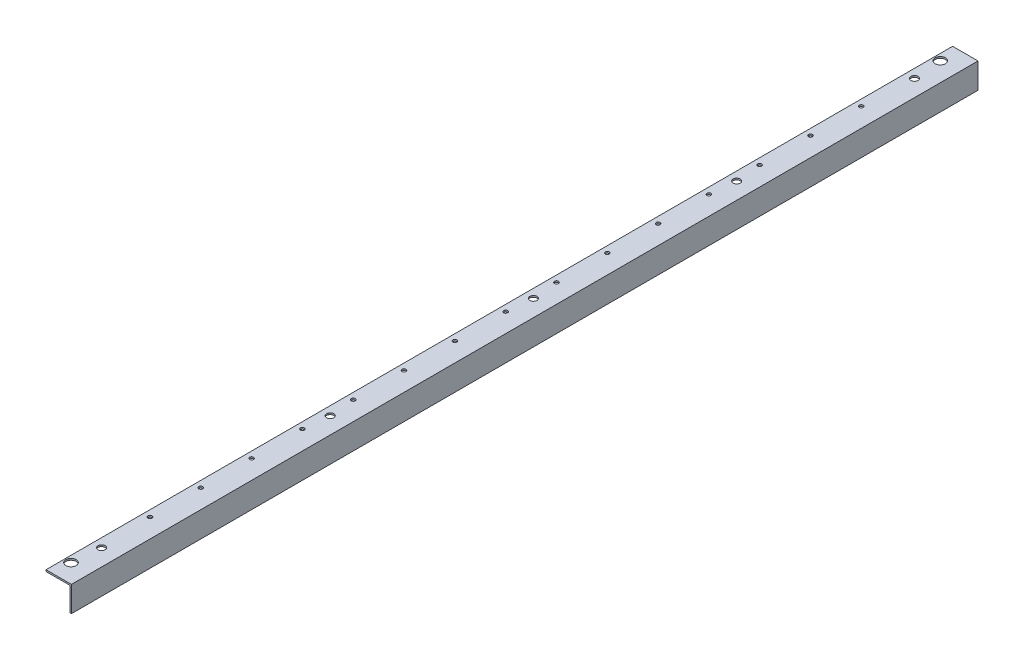
ISO-10303-21;
HEADER;
FILE_DESCRIPTION(('STEP AP214'),'2;1');
FILE_NAME('part.step','',(''),(''),'','','');
FILE_SCHEMA(('AUTOMOTIVE_DESIGN { 1 0 10303 214 1 1 1 1 }'));
ENDSEC;
DATA;
#1=APPLICATION_CONTEXT('core data for automotive mechanical design processes');
#2=APPLICATION_PROTOCOL_DEFINITION('international standard','automotive_design',2000,#1);
#3=PRODUCT_CONTEXT('',#1,'mechanical');
#4=PRODUCT('Part','Part','',(#3));
#5=PRODUCT_RELATED_PRODUCT_CATEGORY('part','',(#4));
#6=PRODUCT_DEFINITION_FORMATION('','',#4);
#7=PRODUCT_DEFINITION_CONTEXT('part definition',#1,'design');
#8=PRODUCT_DEFINITION('design','',#6,#7);
#9=PRODUCT_DEFINITION_SHAPE('','',#8);
#10=(LENGTH_UNIT() NAMED_UNIT(*) SI_UNIT(.MILLI.,.METRE.));
#11=(NAMED_UNIT(*) PLANE_ANGLE_UNIT() SI_UNIT($,.RADIAN.));
#12=(NAMED_UNIT(*) SI_UNIT($,.STERADIAN.) SOLID_ANGLE_UNIT());
#13=UNCERTAINTY_MEASURE_WITH_UNIT(LENGTH_MEASURE(1.E-05),#10,'distance_accuracy_value','');
#14=(GEOMETRIC_REPRESENTATION_CONTEXT(3) GLOBAL_UNCERTAINTY_ASSIGNED_CONTEXT((#13)) GLOBAL_UNIT_ASSIGNED_CONTEXT((#10,
#11,#12)) REPRESENTATION_CONTEXT('',''));
#15=CARTESIAN_POINT('',(0.,0.,0.));
#16=DIRECTION('',(0.,0.,1.));
#17=DIRECTION('',(1.,0.,0.));
#18=AXIS2_PLACEMENT_3D('',#15,#16,#17);
#19=CARTESIAN_POINT('',(-38.1,-44.45,1617.6625));
#20=DIRECTION('',(0.,1.,0.));
#21=DIRECTION('',(0.,0.,1.));
#22=AXIS2_PLACEMENT_3D('',#19,#20,#21);
#23=CYLINDRICAL_SURFACE('',#22,3.96874999999999);
#24=CARTESIAN_POINT('',(-38.1,0.,1617.6625));
#25=DIRECTION('',(0.,1.,0.));
#26=DIRECTION('',(0.,0.,1.));
#27=AXIS2_PLACEMENT_3D('',#24,#25,#26);
#28=CIRCLE('',#27,3.96874999999999);
#29=CARTESIAN_POINT('',(-38.1,0.,1621.63125));
#30=VERTEX_POINT('',#29);
#31=EDGE_CURVE('E44',#30,#30,#28,.T.);
#32=ORIENTED_EDGE('',*,*,#31,.T.);
#33=EDGE_LOOP('',(#32));
#34=FACE_BOUND('',#33,.T.);
#35=CARTESIAN_POINT('',(-38.1,-3.175,1617.6625));
#36=DIRECTION('',(0.,1.,0.));
#37=DIRECTION('',(0.,0.,1.));
#38=AXIS2_PLACEMENT_3D('',#35,#36,#37);
#39=CIRCLE('',#38,3.96874999999999);
#40=CARTESIAN_POINT('',(-38.1,-3.175,1621.63125));
#41=VERTEX_POINT('',#40);
#42=EDGE_CURVE('E11',#41,#41,#39,.T.);
#43=ORIENTED_EDGE('',*,*,#42,.F.);
#44=EDGE_LOOP('',(#43));
#45=FACE_BOUND('',#44,.T.);
#46=ADVANCED_FACE('F36',(#34,#45),#23,.F.);
#47=CARTESIAN_POINT('',(-38.1,-44.45,1516.0625));
#48=DIRECTION('',(0.,1.,0.));
#49=DIRECTION('',(0.,0.,1.));
#50=AXIS2_PLACEMENT_3D('',#47,#48,#49);
#51=CYLINDRICAL_SURFACE('',#50,3.96874999999999);
#52=CARTESIAN_POINT('',(-38.1,0.,1516.0625));
#53=DIRECTION('',(0.,1.,0.));
#54=DIRECTION('',(0.,0.,1.));
#55=AXIS2_PLACEMENT_3D('',#52,#53,#54);
#56=CIRCLE('',#55,3.96874999999999);
#57=CARTESIAN_POINT('',(-38.1,0.,1520.03125));
#58=VERTEX_POINT('',#57);
#59=EDGE_CURVE('E234',#58,#58,#56,.T.);
#60=ORIENTED_EDGE('',*,*,#59,.T.);
#61=EDGE_LOOP('',(#60));
#62=FACE_BOUND('',#61,.T.);
#63=CARTESIAN_POINT('',(-38.1,-3.175,1516.0625));
#64=DIRECTION('',(0.,1.,0.));
#65=DIRECTION('',(0.,0.,1.));
#66=AXIS2_PLACEMENT_3D('',#63,#64,#65);
#67=CIRCLE('',#66,3.96874999999999);
#68=CARTESIAN_POINT('',(-38.1,-3.175,1520.03125));
#69=VERTEX_POINT('',#68);
#70=EDGE_CURVE('E237',#69,#69,#67,.T.);
#71=ORIENTED_EDGE('',*,*,#70,.F.);
#72=EDGE_LOOP('',(#71));
#73=FACE_BOUND('',#72,.T.);
#74=ADVANCED_FACE('F262',(#62,#73),#51,.F.);
#75=CARTESIAN_POINT('',(-38.1,-44.45,1414.4625));
#76=DIRECTION('',(0.,1.,0.));
#77=DIRECTION('',(0.,0.,1.));
#78=AXIS2_PLACEMENT_3D('',#75,#76,#77);
#79=CYLINDRICAL_SURFACE('',#78,3.96874999999999);
#80=CARTESIAN_POINT('',(-38.1,0.,1414.4625));
#81=DIRECTION('',(0.,1.,0.));
#82=DIRECTION('',(0.,0.,1.));
#83=AXIS2_PLACEMENT_3D('',#80,#81,#82);
#84=CIRCLE('',#83,3.96874999999999);
#85=CARTESIAN_POINT('',(-38.1,0.,1418.43125));
#86=VERTEX_POINT('',#85);
#87=EDGE_CURVE('E228',#86,#86,#84,.T.);
#88=ORIENTED_EDGE('',*,*,#87,.T.);
#89=EDGE_LOOP('',(#88));
#90=FACE_BOUND('',#89,.T.);
#91=CARTESIAN_POINT('',(-38.1,-3.175,1414.4625));
#92=DIRECTION('',(0.,1.,0.));
#93=DIRECTION('',(0.,0.,1.));
#94=AXIS2_PLACEMENT_3D('',#91,#92,#93);
#95=CIRCLE('',#94,3.96874999999999);
#96=CARTESIAN_POINT('',(-38.1,-3.175,1418.43125));
#97=VERTEX_POINT('',#96);
#98=EDGE_CURVE('E231',#97,#97,#95,.T.);
#99=ORIENTED_EDGE('',*,*,#98,.F.);
#100=EDGE_LOOP('',(#99));
#101=FACE_BOUND('',#100,.T.);
#102=ADVANCED_FACE('F266',(#90,#101),#79,.F.);
#103=CARTESIAN_POINT('',(-38.1,-44.45,1312.8625));
#104=DIRECTION('',(0.,1.,0.));
#105=DIRECTION('',(0.,0.,1.));
#106=AXIS2_PLACEMENT_3D('',#103,#104,#105);
#107=CYLINDRICAL_SURFACE('',#106,3.96874999999999);
#108=CARTESIAN_POINT('',(-38.1,0.,1312.8625));
#109=DIRECTION('',(0.,1.,0.));
#110=DIRECTION('',(0.,0.,1.));
#111=AXIS2_PLACEMENT_3D('',#108,#109,#110);
#112=CIRCLE('',#111,3.96874999999999);
#113=CARTESIAN_POINT('',(-38.1,0.,1316.83125));
#114=VERTEX_POINT('',#113);
#115=EDGE_CURVE('E222',#114,#114,#112,.T.);
#116=ORIENTED_EDGE('',*,*,#115,.T.);
#117=EDGE_LOOP('',(#116));
#118=FACE_BOUND('',#117,.T.);
#119=CARTESIAN_POINT('',(-38.1,-3.175,1312.8625));
#120=DIRECTION('',(0.,1.,0.));
#121=DIRECTION('',(0.,0.,1.));
#122=AXIS2_PLACEMENT_3D('',#119,#120,#121);
#123=CIRCLE('',#122,3.96874999999999);
#124=CARTESIAN_POINT('',(-38.1,-3.175,1316.83125));
#125=VERTEX_POINT('',#124);
#126=EDGE_CURVE('E225',#125,#125,#123,.T.);
#127=ORIENTED_EDGE('',*,*,#126,.F.);
#128=EDGE_LOOP('',(#127));
#129=FACE_BOUND('',#128,.T.);
#130=ADVANCED_FACE('F271',(#118,#129),#107,.F.);
#131=CARTESIAN_POINT('',(-38.1,-44.45,1211.2625));
#132=DIRECTION('',(0.,1.,0.));
#133=DIRECTION('',(0.,0.,1.));
#134=AXIS2_PLACEMENT_3D('',#131,#132,#133);
#135=CYLINDRICAL_SURFACE('',#134,3.96874999999999);
#136=CARTESIAN_POINT('',(-38.1,0.,1211.2625));
#137=DIRECTION('',(0.,1.,0.));
#138=DIRECTION('',(0.,0.,1.));
#139=AXIS2_PLACEMENT_3D('',#136,#137,#138);
#140=CIRCLE('',#139,3.96874999999999);
#141=CARTESIAN_POINT('',(-38.1,0.,1215.23125));
#142=VERTEX_POINT('',#141);
#143=EDGE_CURVE('E216',#142,#142,#140,.T.);
#144=ORIENTED_EDGE('',*,*,#143,.T.);
#145=EDGE_LOOP('',(#144));
#146=FACE_BOUND('',#145,.T.);
#147=CARTESIAN_POINT('',(-38.1,-3.175,1211.2625));
#148=DIRECTION('',(0.,1.,0.));
#149=DIRECTION('',(0.,0.,1.));
#150=AXIS2_PLACEMENT_3D('',#147,#148,#149);
#151=CIRCLE('',#150,3.96874999999999);
#152=CARTESIAN_POINT('',(-38.1,-3.175,1215.23125));
#153=VERTEX_POINT('',#152);
#154=EDGE_CURVE('E219',#153,#153,#151,.T.);
#155=ORIENTED_EDGE('',*,*,#154,.F.);
#156=EDGE_LOOP('',(#155));
#157=FACE_BOUND('',#156,.T.);
#158=ADVANCED_FACE('F278',(#146,#157),#135,.F.);
#159=CARTESIAN_POINT('',(-38.1,-44.45,1109.6625));
#160=DIRECTION('',(0.,1.,0.));
#161=DIRECTION('',(0.,0.,1.));
#162=AXIS2_PLACEMENT_3D('',#159,#160,#161);
#163=CYLINDRICAL_SURFACE('',#162,3.96874999999999);
#164=CARTESIAN_POINT('',(-38.1,0.,1109.6625));
#165=DIRECTION('',(0.,1.,0.));
#166=DIRECTION('',(0.,0.,1.));
#167=AXIS2_PLACEMENT_3D('',#164,#165,#166);
#168=CIRCLE('',#167,3.96874999999999);
#169=CARTESIAN_POINT('',(-38.1,0.,1113.63125));
#170=VERTEX_POINT('',#169);
#171=EDGE_CURVE('E210',#170,#170,#168,.T.);
#172=ORIENTED_EDGE('',*,*,#171,.T.);
#173=EDGE_LOOP('',(#172));
#174=FACE_BOUND('',#173,.T.);
#175=CARTESIAN_POINT('',(-38.1,-3.175,1109.6625));
#176=DIRECTION('',(0.,1.,0.));
#177=DIRECTION('',(0.,0.,1.));
#178=AXIS2_PLACEMENT_3D('',#175,#176,#177);
#179=CIRCLE('',#178,3.96874999999999);
#180=CARTESIAN_POINT('',(-38.1,-3.175,1113.63125));
#181=VERTEX_POINT('',#180);
#182=EDGE_CURVE('E213',#181,#181,#179,.T.);
#183=ORIENTED_EDGE('',*,*,#182,.F.);
#184=EDGE_LOOP('',(#183));
#185=FACE_BOUND('',#184,.T.);
#186=ADVANCED_FACE('F282',(#174,#185),#163,.F.);
#187=CARTESIAN_POINT('',(-38.1,-44.45,1008.0625));
#188=DIRECTION('',(0.,1.,0.));
#189=DIRECTION('',(0.,0.,1.));
#190=AXIS2_PLACEMENT_3D('',#187,#188,#189);
#191=CYLINDRICAL_SURFACE('',#190,3.96874999999999);
#192=CARTESIAN_POINT('',(-38.1,0.,1008.0625));
#193=DIRECTION('',(0.,1.,0.));
#194=DIRECTION('',(0.,0.,1.));
#195=AXIS2_PLACEMENT_3D('',#192,#193,#194);
#196=CIRCLE('',#195,3.96874999999999);
#197=CARTESIAN_POINT('',(-38.1,0.,1012.03125));
#198=VERTEX_POINT('',#197);
#199=EDGE_CURVE('E204',#198,#198,#196,.T.);
#200=ORIENTED_EDGE('',*,*,#199,.T.);
#201=EDGE_LOOP('',(#200));
#202=FACE_BOUND('',#201,.T.);
#203=CARTESIAN_POINT('',(-38.1,-3.175,1008.0625));
#204=DIRECTION('',(0.,1.,0.));
#205=DIRECTION('',(0.,0.,1.));
#206=AXIS2_PLACEMENT_3D('',#203,#204,#205);
#207=CIRCLE('',#206,3.96874999999999);
#208=CARTESIAN_POINT('',(-38.1,-3.175,1012.03125));
#209=VERTEX_POINT('',#208);
#210=EDGE_CURVE('E207',#209,#209,#207,.T.);
#211=ORIENTED_EDGE('',*,*,#210,.F.);
#212=EDGE_LOOP('',(#211));
#213=FACE_BOUND('',#212,.T.);
#214=ADVANCED_FACE('F286',(#202,#213),#191,.F.);
#215=CARTESIAN_POINT('',(-38.1,-44.45,906.4625));
#216=DIRECTION('',(0.,1.,0.));
#217=DIRECTION('',(0.,0.,1.));
#218=AXIS2_PLACEMENT_3D('',#215,#216,#217);
#219=CYLINDRICAL_SURFACE('',#218,3.96874999999999);
#220=CARTESIAN_POINT('',(-38.1,0.,906.4625));
#221=DIRECTION('',(0.,1.,0.));
#222=DIRECTION('',(0.,0.,1.));
#223=AXIS2_PLACEMENT_3D('',#220,#221,#222);
#224=CIRCLE('',#223,3.96874999999999);
#225=CARTESIAN_POINT('',(-38.1,0.,910.43125));
#226=VERTEX_POINT('',#225);
#227=EDGE_CURVE('E198',#226,#226,#224,.T.);
#228=ORIENTED_EDGE('',*,*,#227,.T.);
#229=EDGE_LOOP('',(#228));
#230=FACE_BOUND('',#229,.T.);
#231=CARTESIAN_POINT('',(-38.1,-3.175,906.4625));
#232=DIRECTION('',(0.,1.,0.));
#233=DIRECTION('',(0.,0.,1.));
#234=AXIS2_PLACEMENT_3D('',#231,#232,#233);
#235=CIRCLE('',#234,3.96874999999999);
#236=CARTESIAN_POINT('',(-38.1,-3.175,910.43125));
#237=VERTEX_POINT('',#236);
#238=EDGE_CURVE('E201',#237,#237,#235,.T.);
#239=ORIENTED_EDGE('',*,*,#238,.F.);
#240=EDGE_LOOP('',(#239));
#241=FACE_BOUND('',#240,.T.);
#242=ADVANCED_FACE('F290',(#230,#241),#219,.F.);
#243=CARTESIAN_POINT('',(-38.1,-44.45,804.8625));
#244=DIRECTION('',(0.,1.,0.));
#245=DIRECTION('',(0.,0.,1.));
#246=AXIS2_PLACEMENT_3D('',#243,#244,#245);
#247=CYLINDRICAL_SURFACE('',#246,3.96874999999999);
#248=CARTESIAN_POINT('',(-38.1,0.,804.8625));
#249=DIRECTION('',(0.,1.,0.));
#250=DIRECTION('',(0.,0.,1.));
#251=AXIS2_PLACEMENT_3D('',#248,#249,#250);
#252=CIRCLE('',#251,3.96874999999999);
#253=CARTESIAN_POINT('',(-38.1,0.,808.83125));
#254=VERTEX_POINT('',#253);
#255=EDGE_CURVE('E192',#254,#254,#252,.T.);
#256=ORIENTED_EDGE('',*,*,#255,.T.);
#257=EDGE_LOOP('',(#256));
#258=FACE_BOUND('',#257,.T.);
#259=CARTESIAN_POINT('',(-38.1,-3.175,804.8625));
#260=DIRECTION('',(0.,1.,0.));
#261=DIRECTION('',(0.,0.,1.));
#262=AXIS2_PLACEMENT_3D('',#259,#260,#261);
#263=CIRCLE('',#262,3.96874999999999);
#264=CARTESIAN_POINT('',(-38.1,-3.175,808.83125));
#265=VERTEX_POINT('',#264);
#266=EDGE_CURVE('E195',#265,#265,#263,.T.);
#267=ORIENTED_EDGE('',*,*,#266,.F.);
#268=EDGE_LOOP('',(#267));
#269=FACE_BOUND('',#268,.T.);
#270=ADVANCED_FACE('F294',(#258,#269),#247,.F.);
#271=CARTESIAN_POINT('',(-38.1,-44.45,703.2625));
#272=DIRECTION('',(0.,1.,0.));
#273=DIRECTION('',(0.,0.,1.));
#274=AXIS2_PLACEMENT_3D('',#271,#272,#273);
#275=CYLINDRICAL_SURFACE('',#274,3.96874999999999);
#276=CARTESIAN_POINT('',(-38.1,0.,703.2625));
#277=DIRECTION('',(0.,1.,0.));
#278=DIRECTION('',(0.,0.,1.));
#279=AXIS2_PLACEMENT_3D('',#276,#277,#278);
#280=CIRCLE('',#279,3.96874999999999);
#281=CARTESIAN_POINT('',(-38.1,0.,707.23125));
#282=VERTEX_POINT('',#281);
#283=EDGE_CURVE('E186',#282,#282,#280,.T.);
#284=ORIENTED_EDGE('',*,*,#283,.T.);
#285=EDGE_LOOP('',(#284));
#286=FACE_BOUND('',#285,.T.);
#287=CARTESIAN_POINT('',(-38.1,-3.175,703.2625));
#288=DIRECTION('',(0.,1.,0.));
#289=DIRECTION('',(0.,0.,1.));
#290=AXIS2_PLACEMENT_3D('',#287,#288,#289);
#291=CIRCLE('',#290,3.96874999999999);
#292=CARTESIAN_POINT('',(-38.1,-3.175,707.23125));
#293=VERTEX_POINT('',#292);
#294=EDGE_CURVE('E189',#293,#293,#291,.T.);
#295=ORIENTED_EDGE('',*,*,#294,.F.);
#296=EDGE_LOOP('',(#295));
#297=FACE_BOUND('',#296,.T.);
#298=ADVANCED_FACE('F298',(#286,#297),#275,.F.);
#299=CARTESIAN_POINT('',(-38.1,-44.45,601.6625));
#300=DIRECTION('',(0.,1.,0.));
#301=DIRECTION('',(0.,0.,1.));
#302=AXIS2_PLACEMENT_3D('',#299,#300,#301);
#303=CYLINDRICAL_SURFACE('',#302,3.96874999999999);
#304=CARTESIAN_POINT('',(-38.1,0.,601.6625));
#305=DIRECTION('',(0.,1.,0.));
#306=DIRECTION('',(0.,0.,1.));
#307=AXIS2_PLACEMENT_3D('',#304,#305,#306);
#308=CIRCLE('',#307,3.96874999999999);
#309=CARTESIAN_POINT('',(-38.1,0.,605.63125));
#310=VERTEX_POINT('',#309);
#311=EDGE_CURVE('E180',#310,#310,#308,.T.);
#312=ORIENTED_EDGE('',*,*,#311,.T.);
#313=EDGE_LOOP('',(#312));
#314=FACE_BOUND('',#313,.T.);
#315=CARTESIAN_POINT('',(-38.1,-3.175,601.6625));
#316=DIRECTION('',(0.,1.,0.));
#317=DIRECTION('',(0.,0.,1.));
#318=AXIS2_PLACEMENT_3D('',#315,#316,#317);
#319=CIRCLE('',#318,3.96874999999999);
#320=CARTESIAN_POINT('',(-38.1,-3.175,605.63125));
#321=VERTEX_POINT('',#320);
#322=EDGE_CURVE('E183',#321,#321,#319,.T.);
#323=ORIENTED_EDGE('',*,*,#322,.F.);
#324=EDGE_LOOP('',(#323));
#325=FACE_BOUND('',#324,.T.);
#326=ADVANCED_FACE('F302',(#314,#325),#303,.F.);
#327=CARTESIAN_POINT('',(-38.1,-44.45,500.0625));
#328=DIRECTION('',(0.,1.,0.));
#329=DIRECTION('',(0.,0.,1.));
#330=AXIS2_PLACEMENT_3D('',#327,#328,#329);
#331=CYLINDRICAL_SURFACE('',#330,3.96874999999999);
#332=CARTESIAN_POINT('',(-38.1,0.,500.0625));
#333=DIRECTION('',(0.,1.,0.));
#334=DIRECTION('',(0.,0.,1.));
#335=AXIS2_PLACEMENT_3D('',#332,#333,#334);
#336=CIRCLE('',#335,3.96874999999999);
#337=CARTESIAN_POINT('',(-38.1,0.,504.03125));
#338=VERTEX_POINT('',#337);
#339=EDGE_CURVE('E174',#338,#338,#336,.T.);
#340=ORIENTED_EDGE('',*,*,#339,.T.);
#341=EDGE_LOOP('',(#340));
#342=FACE_BOUND('',#341,.T.);
#343=CARTESIAN_POINT('',(-38.1,-3.175,500.0625));
#344=DIRECTION('',(0.,1.,0.));
#345=DIRECTION('',(0.,0.,1.));
#346=AXIS2_PLACEMENT_3D('',#343,#344,#345);
#347=CIRCLE('',#346,3.96874999999999);
#348=CARTESIAN_POINT('',(-38.1,-3.175,504.03125));
#349=VERTEX_POINT('',#348);
#350=EDGE_CURVE('E177',#349,#349,#347,.T.);
#351=ORIENTED_EDGE('',*,*,#350,.F.);
#352=EDGE_LOOP('',(#351));
#353=FACE_BOUND('',#352,.T.);
#354=ADVANCED_FACE('F306',(#342,#353),#331,.F.);
#355=CARTESIAN_POINT('',(-38.1,-44.45,398.4625));
#356=DIRECTION('',(0.,1.,0.));
#357=DIRECTION('',(0.,0.,1.));
#358=AXIS2_PLACEMENT_3D('',#355,#356,#357);
#359=CYLINDRICAL_SURFACE('',#358,3.96874999999999);
#360=CARTESIAN_POINT('',(-38.1,0.,398.4625));
#361=DIRECTION('',(0.,1.,0.));
#362=DIRECTION('',(0.,0.,1.));
#363=AXIS2_PLACEMENT_3D('',#360,#361,#362);
#364=CIRCLE('',#363,3.96874999999999);
#365=CARTESIAN_POINT('',(-38.1,0.,402.43125));
#366=VERTEX_POINT('',#365);
#367=EDGE_CURVE('E142',#366,#366,#364,.T.);
#368=ORIENTED_EDGE('',*,*,#367,.T.);
#369=EDGE_LOOP('',(#368));
#370=FACE_BOUND('',#369,.T.);
#371=CARTESIAN_POINT('',(-38.1,-3.175,398.4625));
#372=DIRECTION('',(0.,1.,0.));
#373=DIRECTION('',(0.,0.,1.));
#374=AXIS2_PLACEMENT_3D('',#371,#372,#373);
#375=CIRCLE('',#374,3.96874999999999);
#376=CARTESIAN_POINT('',(-38.1,-3.175,402.43125));
#377=VERTEX_POINT('',#376);
#378=EDGE_CURVE('E171',#377,#377,#375,.T.);
#379=ORIENTED_EDGE('',*,*,#378,.F.);
#380=EDGE_LOOP('',(#379));
#381=FACE_BOUND('',#380,.T.);
#382=ADVANCED_FACE('F256',(#370,#381),#359,.F.);
#383=CARTESIAN_POINT('',(0.,-50.8,1812.925));
#384=DIRECTION('',(-1.,0.,0.));
#385=DIRECTION('',(0.,0.,1.));
#386=AXIS2_PLACEMENT_3D('',#383,#384,#385);
#387=PLANE('',#386);
#388=DIRECTION('',(0.,1.,0.));
#389=VECTOR('',#388,1.);
#390=CARTESIAN_POINT('',(0.,-50.8,0.));
#391=LINE('',#390,#389);
#392=CARTESIAN_POINT('',(0.,-50.8,0.));
#393=VERTEX_POINT('',#392);
#394=CARTESIAN_POINT('',(0.,0.,0.));
#395=VERTEX_POINT('',#394);
#396=EDGE_CURVE('E122',#393,#395,#391,.T.);
#397=ORIENTED_EDGE('',*,*,#396,.T.);
#398=DIRECTION('',(0.,0.,-1.));
#399=VECTOR('',#398,1.);
#400=CARTESIAN_POINT('',(0.,0.,1812.925));
#401=LINE('',#400,#399);
#402=CARTESIAN_POINT('',(0.,0.,1812.925));
#403=VERTEX_POINT('',#402);
#404=EDGE_CURVE('E140',#403,#395,#401,.T.);
#405=ORIENTED_EDGE('',*,*,#404,.F.);
#406=DIRECTION('',(0.,1.,0.));
#407=VECTOR('',#406,1.);
#408=CARTESIAN_POINT('',(0.,-50.8,1812.925));
#409=LINE('',#408,#407);
#410=CARTESIAN_POINT('',(0.,-50.8,1812.925));
#411=VERTEX_POINT('',#410);
#412=EDGE_CURVE('E133',#411,#403,#409,.T.);
#413=ORIENTED_EDGE('',*,*,#412,.F.);
#414=DIRECTION('',(0.,0.,-1.));
#415=VECTOR('',#414,1.);
#416=CARTESIAN_POINT('',(0.,-50.8,1812.925));
#417=LINE('',#416,#415);
#418=EDGE_CURVE('E118',#411,#393,#417,.T.);
#419=ORIENTED_EDGE('',*,*,#418,.T.);
#420=EDGE_LOOP('',(#397,#405,#413,#419));
#421=FACE_BOUND('',#420,.T.);
#422=ADVANCED_FACE('F247',(#421),#387,.F.);
#423=CARTESIAN_POINT('',(0.,0.,1812.925));
#424=DIRECTION('',(0.,-1.,0.));
#425=DIRECTION('',(0.,0.,-1.));
#426=AXIS2_PLACEMENT_3D('',#423,#424,#425);
#427=PLANE('',#426);
#428=CARTESIAN_POINT('',(-38.1,0.,296.8625));
#429=DIRECTION('',(0.,1.,0.));
#430=DIRECTION('',(0.,0.,1.));
#431=AXIS2_PLACEMENT_3D('',#428,#429,#430);
#432=CIRCLE('',#431,3.96874999999999);
#433=CARTESIAN_POINT('',(-38.1,0.,300.83125));
#434=VERTEX_POINT('',#433);
#435=EDGE_CURVE('E410',#434,#434,#432,.T.);
#436=ORIENTED_EDGE('',*,*,#435,.F.);
#437=EDGE_LOOP('',(#436));
#438=FACE_BOUND('',#437,.T.);
#439=CARTESIAN_POINT('',(-38.1,0.,195.2625));
#440=DIRECTION('',(0.,1.,0.));
#441=DIRECTION('',(0.,0.,1.));
#442=AXIS2_PLACEMENT_3D('',#439,#440,#441);
#443=CIRCLE('',#442,3.96874999999999);
#444=CARTESIAN_POINT('',(-38.1,0.,199.23125));
#445=VERTEX_POINT('',#444);
#446=EDGE_CURVE('E168',#445,#445,#443,.T.);
#447=ORIENTED_EDGE('',*,*,#446,.F.);
#448=EDGE_LOOP('',(#447));
#449=FACE_BOUND('',#448,.T.);
#450=CARTESIAN_POINT('',(-38.1,0.,37.3062500000001));
#451=DIRECTION('',(0.,1.,0.));
#452=DIRECTION('',(0.,0.,1.));
#453=AXIS2_PLACEMENT_3D('',#450,#451,#452);
#454=CIRCLE('',#453,10.31875);
#455=CARTESIAN_POINT('',(-38.1,0.,47.6250000000001));
#456=VERTEX_POINT('',#455);
#457=EDGE_CURVE('E147',#456,#456,#454,.T.);
#458=ORIENTED_EDGE('',*,*,#457,.F.);
#459=EDGE_LOOP('',(#458));
#460=FACE_BOUND('',#459,.T.);
#461=CARTESIAN_POINT('',(-33.3375,0.,1719.2625));
#462=DIRECTION('',(0.,1.,0.));
#463=DIRECTION('',(0.,0.,1.));
#464=AXIS2_PLACEMENT_3D('',#461,#462,#463);
#465=CIRCLE('',#464,7.14375000000008);
#466=CARTESIAN_POINT('',(-33.3375,0.,1726.40625));
#467=VERTEX_POINT('',#466);
#468=EDGE_CURVE('E167',#467,#467,#465,.T.);
#469=ORIENTED_EDGE('',*,*,#468,.F.);
#470=EDGE_LOOP('',(#469));
#471=FACE_BOUND('',#470,.T.);
#472=CARTESIAN_POINT('',(-33.3375,0.,1262.0625));
#473=DIRECTION('',(0.,1.,0.));
#474=DIRECTION('',(0.,0.,1.));
#475=AXIS2_PLACEMENT_3D('',#472,#473,#474);
#476=CIRCLE('',#475,7.14375);
#477=CARTESIAN_POINT('',(-33.3375,0.,1269.20625));
#478=VERTEX_POINT('',#477);
#479=EDGE_CURVE('E421',#478,#478,#476,.T.);
#480=ORIENTED_EDGE('',*,*,#479,.F.);
#481=EDGE_LOOP('',(#480));
#482=FACE_BOUND('',#481,.T.);
#483=CARTESIAN_POINT('',(-38.0999999999999,0.,1775.61875));
#484=DIRECTION('',(0.,1.,0.));
#485=DIRECTION('',(0.,0.,1.));
#486=AXIS2_PLACEMENT_3D('',#483,#484,#485);
#487=CIRCLE('',#486,10.31875);
#488=CARTESIAN_POINT('',(-38.0999999999999,0.,1785.9375));
#489=VERTEX_POINT('',#488);
#490=EDGE_CURVE('E420',#489,#489,#487,.T.);
#491=ORIENTED_EDGE('',*,*,#490,.F.);
#492=EDGE_LOOP('',(#491));
#493=FACE_BOUND('',#492,.T.);
#494=CARTESIAN_POINT('',(-33.3375,0.,93.6625));
#495=DIRECTION('',(0.,1.,0.));
#496=DIRECTION('',(0.,0.,1.));
#497=AXIS2_PLACEMENT_3D('',#494,#495,#496);
#498=CIRCLE('',#497,7.14375);
#499=CARTESIAN_POINT('',(-33.3375,0.,100.80625));
#500=VERTEX_POINT('',#499);
#501=EDGE_CURVE('E430',#500,#500,#498,.T.);
#502=ORIENTED_EDGE('',*,*,#501,.F.);
#503=EDGE_LOOP('',(#502));
#504=FACE_BOUND('',#503,.T.);
#505=CARTESIAN_POINT('',(-33.3375,0.,449.2625));
#506=DIRECTION('',(0.,1.,0.));
#507=DIRECTION('',(0.,0.,1.));
#508=AXIS2_PLACEMENT_3D('',#505,#506,#507);
#509=CIRCLE('',#508,7.14375000000002);
#510=CARTESIAN_POINT('',(-33.3375,0.,456.40625));
#511=VERTEX_POINT('',#510);
#512=EDGE_CURVE('E427',#511,#511,#509,.T.);
#513=ORIENTED_EDGE('',*,*,#512,.F.);
#514=EDGE_LOOP('',(#513));
#515=FACE_BOUND('',#514,.T.);
#516=CARTESIAN_POINT('',(-33.3375,0.,855.6625));
#517=DIRECTION('',(0.,1.,0.));
#518=DIRECTION('',(0.,0.,1.));
#519=AXIS2_PLACEMENT_3D('',#516,#517,#518);
#520=CIRCLE('',#519,7.14374999999997);
#521=CARTESIAN_POINT('',(-33.3375,0.,862.80625));
#522=VERTEX_POINT('',#521);
#523=EDGE_CURVE('E424',#522,#522,#520,.T.);
#524=ORIENTED_EDGE('',*,*,#523,.F.);
#525=EDGE_LOOP('',(#524));
#526=FACE_BOUND('',#525,.T.);
#527=DIRECTION('',(-1.,0.,0.));
#528=VECTOR('',#527,1.);
#529=CARTESIAN_POINT('',(0.,0.,0.));
#530=LINE('',#529,#528);
#531=CARTESIAN_POINT('',(-50.8,0.,0.));
#532=VERTEX_POINT('',#531);
#533=EDGE_CURVE('E125',#395,#532,#530,.T.);
#534=ORIENTED_EDGE('',*,*,#533,.T.);
#535=DIRECTION('',(0.,0.,-1.));
#536=VECTOR('',#535,1.);
#537=CARTESIAN_POINT('',(-50.8,0.,1812.925));
#538=LINE('',#537,#536);
#539=CARTESIAN_POINT('',(-50.8,0.,1812.925));
#540=VERTEX_POINT('',#539);
#541=EDGE_CURVE('E137',#540,#532,#538,.T.);
#542=ORIENTED_EDGE('',*,*,#541,.F.);
#543=DIRECTION('',(-1.,0.,0.));
#544=VECTOR('',#543,1.);
#545=CARTESIAN_POINT('',(0.,0.,1812.925));
#546=LINE('',#545,#544);
#547=EDGE_CURVE('E90',#403,#540,#546,.T.);
#548=ORIENTED_EDGE('',*,*,#547,.F.);
#549=ORIENTED_EDGE('',*,*,#404,.T.);
#550=EDGE_LOOP('',(#534,#542,#548,#549));
#551=FACE_BOUND('',#550,.T.);
#552=ORIENTED_EDGE('',*,*,#367,.F.);
#553=EDGE_LOOP('',(#552));
#554=FACE_BOUND('',#553,.T.);
#555=ORIENTED_EDGE('',*,*,#339,.F.);
#556=EDGE_LOOP('',(#555));
#557=FACE_BOUND('',#556,.T.);
#558=ORIENTED_EDGE('',*,*,#311,.F.);
#559=EDGE_LOOP('',(#558));
#560=FACE_BOUND('',#559,.T.);
#561=ORIENTED_EDGE('',*,*,#283,.F.);
#562=EDGE_LOOP('',(#561));
#563=FACE_BOUND('',#562,.T.);
#564=ORIENTED_EDGE('',*,*,#255,.F.);
#565=EDGE_LOOP('',(#564));
#566=FACE_BOUND('',#565,.T.);
#567=ORIENTED_EDGE('',*,*,#227,.F.);
#568=EDGE_LOOP('',(#567));
#569=FACE_BOUND('',#568,.T.);
#570=ORIENTED_EDGE('',*,*,#199,.F.);
#571=EDGE_LOOP('',(#570));
#572=FACE_BOUND('',#571,.T.);
#573=ORIENTED_EDGE('',*,*,#171,.F.);
#574=EDGE_LOOP('',(#573));
#575=FACE_BOUND('',#574,.T.);
#576=ORIENTED_EDGE('',*,*,#143,.F.);
#577=EDGE_LOOP('',(#576));
#578=FACE_BOUND('',#577,.T.);
#579=ORIENTED_EDGE('',*,*,#115,.F.);
#580=EDGE_LOOP('',(#579));
#581=FACE_BOUND('',#580,.T.);
#582=ORIENTED_EDGE('',*,*,#87,.F.);
#583=EDGE_LOOP('',(#582));
#584=FACE_BOUND('',#583,.T.);
#585=ORIENTED_EDGE('',*,*,#59,.F.);
#586=EDGE_LOOP('',(#585));
#587=FACE_BOUND('',#586,.T.);
#588=ORIENTED_EDGE('',*,*,#31,.F.);
#589=EDGE_LOOP('',(#588));
#590=FACE_BOUND('',#589,.T.);
#591=ADVANCED_FACE('F244',(#438,#449,#460,#471,#482,#493,#504,#515,#526,#551,#554,#557,#560,
#563,#566,#569,#572,#575,#578,#581,#584,#587,#590),#427,.F.);
#592=CARTESIAN_POINT('',(-50.8,0.,1812.925));
#593=DIRECTION('',(1.,0.,0.));
#594=DIRECTION('',(0.,0.,-1.));
#595=AXIS2_PLACEMENT_3D('',#592,#593,#594);
#596=PLANE('',#595);
#597=DIRECTION('',(0.,-1.,0.));
#598=VECTOR('',#597,1.);
#599=CARTESIAN_POINT('',(-50.8,0.,0.));
#600=LINE('',#599,#598);
#601=CARTESIAN_POINT('',(-50.8,-3.17500000000001,0.));
#602=VERTEX_POINT('',#601);
#603=EDGE_CURVE('E128',#532,#602,#600,.T.);
#604=ORIENTED_EDGE('',*,*,#603,.T.);
#605=DIRECTION('',(0.,0.,-1.));
#606=VECTOR('',#605,1.);
#607=CARTESIAN_POINT('',(-50.8,-3.17500000000001,1812.925));
#608=LINE('',#607,#606);
#609=CARTESIAN_POINT('',(-50.8,-3.17500000000001,1812.925));
#610=VERTEX_POINT('',#609);
#611=EDGE_CURVE('E113',#610,#602,#608,.T.);
#612=ORIENTED_EDGE('',*,*,#611,.F.);
#613=DIRECTION('',(0.,-1.,0.));
#614=VECTOR('',#613,1.);
#615=CARTESIAN_POINT('',(-50.8,0.,1812.925));
#616=LINE('',#615,#614);
#617=EDGE_CURVE('E103',#540,#610,#616,.T.);
#618=ORIENTED_EDGE('',*,*,#617,.F.);
#619=ORIENTED_EDGE('',*,*,#541,.T.);
#620=EDGE_LOOP('',(#604,#612,#618,#619));
#621=FACE_BOUND('',#620,.T.);
#622=ADVANCED_FACE('F246',(#621),#596,.F.);
#623=CARTESIAN_POINT('',(-50.8,-3.17500000000001,1812.925));
#624=DIRECTION('',(0.,1.,0.));
#625=DIRECTION('',(0.,0.,1.));
#626=AXIS2_PLACEMENT_3D('',#623,#624,#625);
#627=PLANE('',#626);
#628=CARTESIAN_POINT('',(-38.1,-3.175,296.8625));
#629=DIRECTION('',(0.,1.,0.));
#630=DIRECTION('',(0.,0.,1.));
#631=AXIS2_PLACEMENT_3D('',#628,#629,#630);
#632=CIRCLE('',#631,3.96874999999999);
#633=CARTESIAN_POINT('',(-38.1,-3.175,300.83125));
#634=VERTEX_POINT('',#633);
#635=EDGE_CURVE('E412',#634,#634,#632,.T.);
#636=ORIENTED_EDGE('',*,*,#635,.T.);
#637=EDGE_LOOP('',(#636));
#638=FACE_BOUND('',#637,.T.);
#639=CARTESIAN_POINT('',(-38.1,-3.175,195.2625));
#640=DIRECTION('',(0.,1.,0.));
#641=DIRECTION('',(0.,0.,1.));
#642=AXIS2_PLACEMENT_3D('',#639,#640,#641);
#643=CIRCLE('',#642,3.96874999999999);
#644=CARTESIAN_POINT('',(-38.1,-3.175,199.23125));
#645=VERTEX_POINT('',#644);
#646=EDGE_CURVE('E164',#645,#645,#643,.T.);
#647=ORIENTED_EDGE('',*,*,#646,.T.);
#648=EDGE_LOOP('',(#647));
#649=FACE_BOUND('',#648,.T.);
#650=CARTESIAN_POINT('',(-38.1,-3.175,37.3062500000001));
#651=DIRECTION('',(0.,1.,0.));
#652=DIRECTION('',(0.,0.,1.));
#653=AXIS2_PLACEMENT_3D('',#650,#651,#652);
#654=CIRCLE('',#653,10.31875);
#655=CARTESIAN_POINT('',(-38.1,-3.175,47.6250000000001));
#656=VERTEX_POINT('',#655);
#657=EDGE_CURVE('E126',#656,#656,#654,.T.);
#658=ORIENTED_EDGE('',*,*,#657,.T.);
#659=EDGE_LOOP('',(#658));
#660=FACE_BOUND('',#659,.T.);
#661=CARTESIAN_POINT('',(-33.3375,-3.175,1719.2625));
#662=DIRECTION('',(0.,1.,0.));
#663=DIRECTION('',(0.,0.,1.));
#664=AXIS2_PLACEMENT_3D('',#661,#662,#663);
#665=CIRCLE('',#664,7.14375000000008);
#666=CARTESIAN_POINT('',(-33.3375,-3.175,1726.40625));
#667=VERTEX_POINT('',#666);
#668=EDGE_CURVE('E159',#667,#667,#665,.T.);
#669=ORIENTED_EDGE('',*,*,#668,.T.);
#670=EDGE_LOOP('',(#669));
#671=FACE_BOUND('',#670,.T.);
#672=CARTESIAN_POINT('',(-33.3375,-3.175,1262.0625));
#673=DIRECTION('',(0.,1.,0.));
#674=DIRECTION('',(0.,0.,1.));
#675=AXIS2_PLACEMENT_3D('',#672,#673,#674);
#676=CIRCLE('',#675,7.14375);
#677=CARTESIAN_POINT('',(-33.3375,-3.175,1269.20625));
#678=VERTEX_POINT('',#677);
#679=EDGE_CURVE('E156',#678,#678,#676,.T.);
#680=ORIENTED_EDGE('',*,*,#679,.T.);
#681=EDGE_LOOP('',(#680));
#682=FACE_BOUND('',#681,.T.);
#683=CARTESIAN_POINT('',(-38.0999999999999,-3.175,1775.61875));
#684=DIRECTION('',(0.,1.,0.));
#685=DIRECTION('',(0.,0.,1.));
#686=AXIS2_PLACEMENT_3D('',#683,#684,#685);
#687=CIRCLE('',#686,10.31875);
#688=CARTESIAN_POINT('',(-38.0999999999999,-3.175,1785.9375));
#689=VERTEX_POINT('',#688);
#690=EDGE_CURVE('E153',#689,#689,#687,.T.);
#691=ORIENTED_EDGE('',*,*,#690,.T.);
#692=EDGE_LOOP('',(#691));
#693=FACE_BOUND('',#692,.T.);
#694=CARTESIAN_POINT('',(-33.3375,-3.175,93.6625));
#695=DIRECTION('',(0.,1.,0.));
#696=DIRECTION('',(0.,0.,1.));
#697=AXIS2_PLACEMENT_3D('',#694,#695,#696);
#698=CIRCLE('',#697,7.14375);
#699=CARTESIAN_POINT('',(-33.3375,-3.175,100.80625));
#700=VERTEX_POINT('',#699);
#701=EDGE_CURVE('E150',#700,#700,#698,.T.);
#702=ORIENTED_EDGE('',*,*,#701,.T.);
#703=EDGE_LOOP('',(#702));
#704=FACE_BOUND('',#703,.T.);
#705=CARTESIAN_POINT('',(-33.3375,-3.175,449.2625));
#706=DIRECTION('',(0.,1.,0.));
#707=DIRECTION('',(0.,0.,1.));
#708=AXIS2_PLACEMENT_3D('',#705,#706,#707);
#709=CIRCLE('',#708,7.14375000000002);
#710=CARTESIAN_POINT('',(-33.3375,-3.175,456.40625));
#711=VERTEX_POINT('',#710);
#712=EDGE_CURVE('E146',#711,#711,#709,.T.);
#713=ORIENTED_EDGE('',*,*,#712,.T.);
#714=EDGE_LOOP('',(#713));
#715=FACE_BOUND('',#714,.T.);
#716=CARTESIAN_POINT('',(-33.3375,-3.175,855.6625));
#717=DIRECTION('',(0.,1.,0.));
#718=DIRECTION('',(0.,0.,1.));
#719=AXIS2_PLACEMENT_3D('',#716,#717,#718);
#720=CIRCLE('',#719,7.14374999999997);
#721=CARTESIAN_POINT('',(-33.3375,-3.175,862.80625));
#722=VERTEX_POINT('',#721);
#723=EDGE_CURVE('E143',#722,#722,#720,.T.);
#724=ORIENTED_EDGE('',*,*,#723,.T.);
#725=EDGE_LOOP('',(#724));
#726=FACE_BOUND('',#725,.T.);
#727=DIRECTION('',(1.,0.,0.));
#728=VECTOR('',#727,1.);
#729=CARTESIAN_POINT('',(-50.8,-3.17500000000001,0.));
#730=LINE('',#729,#728);
#731=CARTESIAN_POINT('',(-3.17500000000001,-3.17500000000001,0.));
#732=VERTEX_POINT('',#731);
#733=EDGE_CURVE('E112',#602,#732,#730,.T.);
#734=ORIENTED_EDGE('',*,*,#733,.T.);
#735=DIRECTION('',(0.,0.,-1.));
#736=VECTOR('',#735,1.);
#737=CARTESIAN_POINT('',(-3.17500000000001,-3.17500000000001,1812.925));
#738=LINE('',#737,#736);
#739=CARTESIAN_POINT('',(-3.17500000000001,-3.17500000000001,1812.925));
#740=VERTEX_POINT('',#739);
#741=EDGE_CURVE('E108',#740,#732,#738,.T.);
#742=ORIENTED_EDGE('',*,*,#741,.F.);
#743=DIRECTION('',(1.,0.,0.));
#744=VECTOR('',#743,1.);
#745=CARTESIAN_POINT('',(-50.8,-3.17500000000001,1812.925));
#746=LINE('',#745,#744);
#747=EDGE_CURVE('E97',#610,#740,#746,.T.);
#748=ORIENTED_EDGE('',*,*,#747,.F.);
#749=ORIENTED_EDGE('',*,*,#611,.T.);
#750=EDGE_LOOP('',(#734,#742,#748,#749));
#751=FACE_BOUND('',#750,.T.);
#752=ORIENTED_EDGE('',*,*,#378,.T.);
#753=EDGE_LOOP('',(#752));
#754=FACE_BOUND('',#753,.T.);
#755=ORIENTED_EDGE('',*,*,#350,.T.);
#756=EDGE_LOOP('',(#755));
#757=FACE_BOUND('',#756,.T.);
#758=ORIENTED_EDGE('',*,*,#322,.T.);
#759=EDGE_LOOP('',(#758));
#760=FACE_BOUND('',#759,.T.);
#761=ORIENTED_EDGE('',*,*,#294,.T.);
#762=EDGE_LOOP('',(#761));
#763=FACE_BOUND('',#762,.T.);
#764=ORIENTED_EDGE('',*,*,#266,.T.);
#765=EDGE_LOOP('',(#764));
#766=FACE_BOUND('',#765,.T.);
#767=ORIENTED_EDGE('',*,*,#238,.T.);
#768=EDGE_LOOP('',(#767));
#769=FACE_BOUND('',#768,.T.);
#770=ORIENTED_EDGE('',*,*,#210,.T.);
#771=EDGE_LOOP('',(#770));
#772=FACE_BOUND('',#771,.T.);
#773=ORIENTED_EDGE('',*,*,#182,.T.);
#774=EDGE_LOOP('',(#773));
#775=FACE_BOUND('',#774,.T.);
#776=ORIENTED_EDGE('',*,*,#154,.T.);
#777=EDGE_LOOP('',(#776));
#778=FACE_BOUND('',#777,.T.);
#779=ORIENTED_EDGE('',*,*,#126,.T.);
#780=EDGE_LOOP('',(#779));
#781=FACE_BOUND('',#780,.T.);
#782=ORIENTED_EDGE('',*,*,#98,.T.);
#783=EDGE_LOOP('',(#782));
#784=FACE_BOUND('',#783,.T.);
#785=ORIENTED_EDGE('',*,*,#70,.T.);
#786=EDGE_LOOP('',(#785));
#787=FACE_BOUND('',#786,.T.);
#788=ORIENTED_EDGE('',*,*,#42,.T.);
#789=EDGE_LOOP('',(#788));
#790=FACE_BOUND('',#789,.T.);
#791=ADVANCED_FACE('F109',(#638,#649,#660,#671,#682,#693,#704,#715,#726,#751,#754,#757,#760,
#763,#766,#769,#772,#775,#778,#781,#784,#787,#790),#627,.F.);
#792=CARTESIAN_POINT('',(-3.17500000000001,-3.17500000000001,1812.925));
#793=DIRECTION('',(1.,0.,0.));
#794=DIRECTION('',(0.,1.,0.));
#795=AXIS2_PLACEMENT_3D('',#792,#793,#794);
#796=PLANE('',#795);
#797=DIRECTION('',(0.,-1.,0.));
#798=VECTOR('',#797,1.);
#799=CARTESIAN_POINT('',(-3.17500000000001,-3.17500000000001,0.));
#800=LINE('',#799,#798);
#801=CARTESIAN_POINT('',(-3.175,-50.8,0.));
#802=VERTEX_POINT('',#801);
#803=EDGE_CURVE('E75',#732,#802,#800,.T.);
#804=ORIENTED_EDGE('',*,*,#803,.T.);
#805=DIRECTION('',(0.,0.,-1.));
#806=VECTOR('',#805,1.);
#807=CARTESIAN_POINT('',(-3.175,-50.8,1812.925));
#808=LINE('',#807,#806);
#809=CARTESIAN_POINT('',(-3.175,-50.8,1812.925));
#810=VERTEX_POINT('',#809);
#811=EDGE_CURVE('E114',#810,#802,#808,.T.);
#812=ORIENTED_EDGE('',*,*,#811,.F.);
#813=DIRECTION('',(0.,-1.,0.));
#814=VECTOR('',#813,1.);
#815=CARTESIAN_POINT('',(-3.17500000000001,-3.17500000000001,1812.925));
#816=LINE('',#815,#814);
#817=EDGE_CURVE('E101',#740,#810,#816,.T.);
#818=ORIENTED_EDGE('',*,*,#817,.F.);
#819=ORIENTED_EDGE('',*,*,#741,.T.);
#820=EDGE_LOOP('',(#804,#812,#818,#819));
#821=FACE_BOUND('',#820,.T.);
#822=ADVANCED_FACE('F116',(#821),#796,.F.);
#823=CARTESIAN_POINT('',(-3.175,-50.8,1812.925));
#824=DIRECTION('',(0.,1.,0.));
#825=DIRECTION('',(0.,0.,1.));
#826=AXIS2_PLACEMENT_3D('',#823,#824,#825);
#827=PLANE('',#826);
#828=DIRECTION('',(1.,0.,0.));
#829=VECTOR('',#828,1.);
#830=CARTESIAN_POINT('',(-3.175,-50.8,0.));
#831=LINE('',#830,#829);
#832=EDGE_CURVE('E81',#802,#393,#831,.T.);
#833=ORIENTED_EDGE('',*,*,#832,.T.);
#834=ORIENTED_EDGE('',*,*,#418,.F.);
#835=DIRECTION('',(1.,0.,0.));
#836=VECTOR('',#835,1.);
#837=CARTESIAN_POINT('',(-3.175,-50.8,1812.925));
#838=LINE('',#837,#836);
#839=EDGE_CURVE('E52',#810,#411,#838,.T.);
#840=ORIENTED_EDGE('',*,*,#839,.F.);
#841=ORIENTED_EDGE('',*,*,#811,.T.);
#842=EDGE_LOOP('',(#833,#834,#840,#841));
#843=FACE_BOUND('',#842,.T.);
#844=ADVANCED_FACE('F358',(#843),#827,.F.);
#845=CARTESIAN_POINT('',(0.,0.,1812.925));
#846=DIRECTION('',(0.,0.,1.));
#847=DIRECTION('',(1.,0.,0.));
#848=AXIS2_PLACEMENT_3D('',#845,#846,#847);
#849=PLANE('',#848);
#850=ORIENTED_EDGE('',*,*,#412,.T.);
#851=ORIENTED_EDGE('',*,*,#547,.T.);
#852=ORIENTED_EDGE('',*,*,#617,.T.);
#853=ORIENTED_EDGE('',*,*,#747,.T.);
#854=ORIENTED_EDGE('',*,*,#817,.T.);
#855=ORIENTED_EDGE('',*,*,#839,.T.);
#856=EDGE_LOOP('',(#850,#851,#852,#853,#854,#855));
#857=FACE_BOUND('',#856,.T.);
#858=ADVANCED_FACE('F99',(#857),#849,.T.);
#859=CARTESIAN_POINT('',(0.,0.,0.));
#860=DIRECTION('',(0.,0.,1.));
#861=DIRECTION('',(1.,0.,0.));
#862=AXIS2_PLACEMENT_3D('',#859,#860,#861);
#863=PLANE('',#862);
#864=ORIENTED_EDGE('',*,*,#396,.F.);
#865=ORIENTED_EDGE('',*,*,#832,.F.);
#866=ORIENTED_EDGE('',*,*,#803,.F.);
#867=ORIENTED_EDGE('',*,*,#733,.F.);
#868=ORIENTED_EDGE('',*,*,#603,.F.);
#869=ORIENTED_EDGE('',*,*,#533,.F.);
#870=EDGE_LOOP('',(#864,#865,#866,#867,#868,#869));
#871=FACE_BOUND('',#870,.T.);
#872=ADVANCED_FACE('F365',(#871),#863,.F.);
#873=CARTESIAN_POINT('',(-33.3375,-50.8,855.6625));
#874=DIRECTION('',(0.,1.,0.));
#875=DIRECTION('',(0.,0.,1.));
#876=AXIS2_PLACEMENT_3D('',#873,#874,#875);
#877=CYLINDRICAL_SURFACE('',#876,7.14374999999997);
#878=ORIENTED_EDGE('',*,*,#523,.T.);
#879=EDGE_LOOP('',(#878));
#880=FACE_BOUND('',#879,.T.);
#881=ORIENTED_EDGE('',*,*,#723,.F.);
#882=EDGE_LOOP('',(#881));
#883=FACE_BOUND('',#882,.T.);
#884=ADVANCED_FACE('F368',(#880,#883),#877,.F.);
#885=CARTESIAN_POINT('',(-33.3375,-50.8,449.2625));
#886=DIRECTION('',(0.,1.,0.));
#887=DIRECTION('',(0.,0.,1.));
#888=AXIS2_PLACEMENT_3D('',#885,#886,#887);
#889=CYLINDRICAL_SURFACE('',#888,7.14375000000002);
#890=ORIENTED_EDGE('',*,*,#512,.T.);
#891=EDGE_LOOP('',(#890));
#892=FACE_BOUND('',#891,.T.);
#893=ORIENTED_EDGE('',*,*,#712,.F.);
#894=EDGE_LOOP('',(#893));
#895=FACE_BOUND('',#894,.T.);
#896=ADVANCED_FACE('F376',(#892,#895),#889,.F.);
#897=CARTESIAN_POINT('',(-33.3375,-50.8,93.6625));
#898=DIRECTION('',(0.,1.,0.));
#899=DIRECTION('',(0.,0.,1.));
#900=AXIS2_PLACEMENT_3D('',#897,#898,#899);
#901=CYLINDRICAL_SURFACE('',#900,7.14375);
#902=ORIENTED_EDGE('',*,*,#501,.T.);
#903=EDGE_LOOP('',(#902));
#904=FACE_BOUND('',#903,.T.);
#905=ORIENTED_EDGE('',*,*,#701,.F.);
#906=EDGE_LOOP('',(#905));
#907=FACE_BOUND('',#906,.T.);
#908=ADVANCED_FACE('F372',(#904,#907),#901,.F.);
#909=CARTESIAN_POINT('',(-38.0999999999999,-50.8,1775.61875));
#910=DIRECTION('',(0.,1.,0.));
#911=DIRECTION('',(0.,0.,1.));
#912=AXIS2_PLACEMENT_3D('',#909,#910,#911);
#913=CYLINDRICAL_SURFACE('',#912,10.31875);
#914=ORIENTED_EDGE('',*,*,#490,.T.);
#915=EDGE_LOOP('',(#914));
#916=FACE_BOUND('',#915,.T.);
#917=ORIENTED_EDGE('',*,*,#690,.F.);
#918=EDGE_LOOP('',(#917));
#919=FACE_BOUND('',#918,.T.);
#920=ADVANCED_FACE('F375',(#916,#919),#913,.F.);
#921=CARTESIAN_POINT('',(-33.3375,-50.8,1262.0625));
#922=DIRECTION('',(0.,1.,0.));
#923=DIRECTION('',(0.,0.,1.));
#924=AXIS2_PLACEMENT_3D('',#921,#922,#923);
#925=CYLINDRICAL_SURFACE('',#924,7.14375);
#926=ORIENTED_EDGE('',*,*,#479,.T.);
#927=EDGE_LOOP('',(#926));
#928=FACE_BOUND('',#927,.T.);
#929=ORIENTED_EDGE('',*,*,#679,.F.);
#930=EDGE_LOOP('',(#929));
#931=FACE_BOUND('',#930,.T.);
#932=ADVANCED_FACE('F380',(#928,#931),#925,.F.);
#933=CARTESIAN_POINT('',(-33.3375,-50.8,1719.2625));
#934=DIRECTION('',(0.,1.,0.));
#935=DIRECTION('',(0.,0.,1.));
#936=AXIS2_PLACEMENT_3D('',#933,#934,#935);
#937=CYLINDRICAL_SURFACE('',#936,7.14375000000008);
#938=ORIENTED_EDGE('',*,*,#468,.T.);
#939=EDGE_LOOP('',(#938));
#940=FACE_BOUND('',#939,.T.);
#941=ORIENTED_EDGE('',*,*,#668,.F.);
#942=EDGE_LOOP('',(#941));
#943=FACE_BOUND('',#942,.T.);
#944=ADVANCED_FACE('F388',(#940,#943),#937,.F.);
#945=CARTESIAN_POINT('',(-38.1,-50.8,37.3062500000001));
#946=DIRECTION('',(0.,1.,0.));
#947=DIRECTION('',(0.,0.,1.));
#948=AXIS2_PLACEMENT_3D('',#945,#946,#947);
#949=CYLINDRICAL_SURFACE('',#948,10.31875);
#950=ORIENTED_EDGE('',*,*,#457,.T.);
#951=EDGE_LOOP('',(#950));
#952=FACE_BOUND('',#951,.T.);
#953=ORIENTED_EDGE('',*,*,#657,.F.);
#954=EDGE_LOOP('',(#953));
#955=FACE_BOUND('',#954,.T.);
#956=ADVANCED_FACE('F391',(#952,#955),#949,.F.);
#957=CARTESIAN_POINT('',(-38.1,-44.45,195.2625));
#958=DIRECTION('',(0.,1.,0.));
#959=DIRECTION('',(0.,0.,1.));
#960=AXIS2_PLACEMENT_3D('',#957,#958,#959);
#961=CYLINDRICAL_SURFACE('',#960,3.96874999999999);
#962=ORIENTED_EDGE('',*,*,#446,.T.);
#963=EDGE_LOOP('',(#962));
#964=FACE_BOUND('',#963,.T.);
#965=ORIENTED_EDGE('',*,*,#646,.F.);
#966=EDGE_LOOP('',(#965));
#967=FACE_BOUND('',#966,.T.);
#968=ADVANCED_FACE('F398',(#964,#967),#961,.F.);
#969=CARTESIAN_POINT('',(-38.1,-44.45,296.8625));
#970=DIRECTION('',(0.,1.,0.));
#971=DIRECTION('',(0.,0.,1.));
#972=AXIS2_PLACEMENT_3D('',#969,#970,#971);
#973=CYLINDRICAL_SURFACE('',#972,3.96874999999999);
#974=ORIENTED_EDGE('',*,*,#435,.T.);
#975=EDGE_LOOP('',(#974));
#976=FACE_BOUND('',#975,.T.);
#977=ORIENTED_EDGE('',*,*,#635,.F.);
#978=EDGE_LOOP('',(#977));
#979=FACE_BOUND('',#978,.T.);
#980=ADVANCED_FACE('F402',(#976,#979),#973,.F.);
#981=CLOSED_SHELL('',(#46,#74,#102,#130,#158,#186,#214,#242,#270,#298,#326,#354,#382,#422,#591,
#622,#791,#822,#844,#858,#872,#884,#896,#908,#920,#932,#944,#956,#968,#980));
#982=MANIFOLD_SOLID_BREP('B2',#981);
#983=ADVANCED_BREP_SHAPE_REPRESENTATION('',(#18,#982),#14);
#984=SHAPE_DEFINITION_REPRESENTATION(#9,#983);
ENDSEC;
END-ISO-10303-21;
